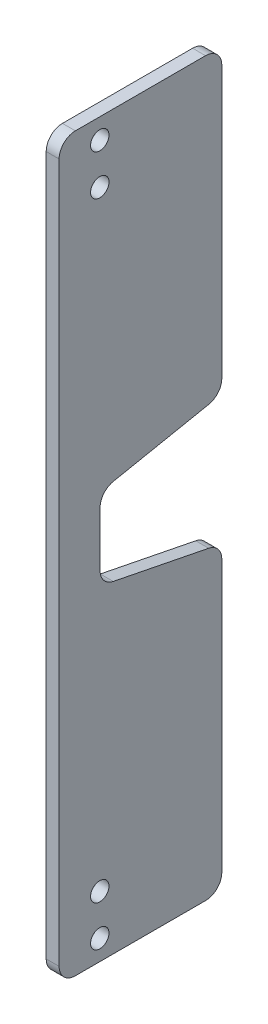
ISO-10303-21;
HEADER;
FILE_DESCRIPTION(('STEP AP214'),'2;1');
FILE_NAME('part.step','',(''),(''),'','','');
FILE_SCHEMA(('AUTOMOTIVE_DESIGN { 1 0 10303 214 1 1 1 1 }'));
ENDSEC;
DATA;
#1=APPLICATION_CONTEXT('core data for automotive mechanical design processes');
#2=APPLICATION_PROTOCOL_DEFINITION('international standard','automotive_design',2000,#1);
#3=PRODUCT_CONTEXT('',#1,'mechanical');
#4=PRODUCT('Part','Part','',(#3));
#5=PRODUCT_RELATED_PRODUCT_CATEGORY('part','',(#4));
#6=PRODUCT_DEFINITION_FORMATION('','',#4);
#7=PRODUCT_DEFINITION_CONTEXT('part definition',#1,'design');
#8=PRODUCT_DEFINITION('design','',#6,#7);
#9=PRODUCT_DEFINITION_SHAPE('','',#8);
#10=(LENGTH_UNIT() NAMED_UNIT(*) SI_UNIT(.MILLI.,.METRE.));
#11=(NAMED_UNIT(*) PLANE_ANGLE_UNIT() SI_UNIT($,.RADIAN.));
#12=(NAMED_UNIT(*) SI_UNIT($,.STERADIAN.) SOLID_ANGLE_UNIT());
#13=UNCERTAINTY_MEASURE_WITH_UNIT(LENGTH_MEASURE(1.E-05),#10,'distance_accuracy_value','');
#14=(GEOMETRIC_REPRESENTATION_CONTEXT(3) GLOBAL_UNCERTAINTY_ASSIGNED_CONTEXT((#13)) GLOBAL_UNIT_ASSIGNED_CONTEXT((#10,
#11,#12)) REPRESENTATION_CONTEXT('',''));
#15=CARTESIAN_POINT('',(0.,0.,0.));
#16=DIRECTION('',(0.,0.,1.));
#17=DIRECTION('',(1.,0.,0.));
#18=AXIS2_PLACEMENT_3D('',#15,#16,#17);
#19=CARTESIAN_POINT('',(0.794249999999999,-50.77,-0.0391447555514955));
#20=DIRECTION('',(0.,-0.980796557409384,-0.195033620111768));
#21=DIRECTION('',(0.,0.195033620111768,-0.980796557409384));
#22=AXIS2_PLACEMENT_3D('',#19,#20,#21);
#23=PLANE('',#22);
#24=DIRECTION('',(0.,-0.195033620111768,0.980796557409384));
#25=VECTOR('',#24,1.);
#26=CARTESIAN_POINT('',(-0.793750000000002,-50.77,-0.039144755551496));
#27=LINE('',#26,#25);
#28=CARTESIAN_POINT('',(-0.793749999999997,-48.1151387809773,-13.3900672402235));
#29=VERTEX_POINT('',#28);
#30=CARTESIAN_POINT('',(-0.793750000000001,-50.4498612190227,-1.64907751532796));
#31=VERTEX_POINT('',#30);
#32=EDGE_CURVE('E202',#29,#31,#27,.T.);
#33=ORIENTED_EDGE('',*,*,#32,.F.);
#34=DIRECTION('',(-1.,0.,0.));
#35=VECTOR('',#34,1.);
#36=CARTESIAN_POINT('',(0.794250000000003,-48.1151387809773,-13.3900672402235));
#37=LINE('',#36,#35);
#38=CARTESIAN_POINT('',(0.794250000000003,-48.1151387809773,-13.3900672402235));
#39=VERTEX_POINT('',#38);
#40=EDGE_CURVE('E289',#29,#39,#37,.F.);
#41=ORIENTED_EDGE('',*,*,#40,.T.);
#42=DIRECTION('',(0.,-0.195033620111768,0.980796557409384));
#43=VECTOR('',#42,1.);
#44=CARTESIAN_POINT('',(0.794249999999999,-50.77,-0.0391447555514955));
#45=LINE('',#44,#43);
#46=CARTESIAN_POINT('',(0.794249999999999,-50.4498612190227,-1.64907751532796));
#47=VERTEX_POINT('',#46);
#48=EDGE_CURVE('E246',#39,#47,#45,.T.);
#49=ORIENTED_EDGE('',*,*,#48,.T.);
#50=DIRECTION('',(-1.,0.,0.));
#51=VECTOR('',#50,1.);
#52=CARTESIAN_POINT('',(-0.793750000000001,-50.4498612190227,-1.64907751532796));
#53=LINE('',#52,#51);
#54=EDGE_CURVE('E250',#47,#31,#53,.T.);
#55=ORIENTED_EDGE('',*,*,#54,.T.);
#56=EDGE_LOOP('',(#33,#41,#49,#55));
#57=FACE_BOUND('',#56,.T.);
#58=ADVANCED_FACE('F38',(#57),#23,.T.);
#59=CARTESIAN_POINT('',(0.794250000000003,-12.795,-15.));
#60=DIRECTION('',(0.,0.,-1.));
#61=DIRECTION('',(-1.,0.,0.));
#62=AXIS2_PLACEMENT_3D('',#59,#60,#61);
#63=PLANE('',#62);
#64=DIRECTION('',(0.,-1.,0.));
#65=VECTOR('',#64,1.);
#66=CARTESIAN_POINT('',(0.794250000000003,-12.795,-15.));
#67=LINE('',#66,#65);
#68=CARTESIAN_POINT('',(0.794250000000003,-12.795,-15.));
#69=VERTEX_POINT('',#68);
#70=CARTESIAN_POINT('',(0.794250000000003,-46.1535456661585,-15.));
#71=VERTEX_POINT('',#70);
#72=EDGE_CURVE('E167',#69,#71,#67,.T.);
#73=ORIENTED_EDGE('',*,*,#72,.T.);
#74=DIRECTION('',(-1.,0.,0.));
#75=VECTOR('',#74,1.);
#76=CARTESIAN_POINT('',(0.794250000000003,-46.1535456661585,-15.));
#77=LINE('',#76,#75);
#78=CARTESIAN_POINT('',(-0.793749999999997,-46.1535456661585,-15.));
#79=VERTEX_POINT('',#78);
#80=EDGE_CURVE('E282',#71,#79,#77,.T.);
#81=ORIENTED_EDGE('',*,*,#80,.T.);
#82=DIRECTION('',(0.,-1.,0.));
#83=VECTOR('',#82,1.);
#84=CARTESIAN_POINT('',(-0.793749999999997,-12.795,-15.));
#85=LINE('',#84,#83);
#86=CARTESIAN_POINT('',(-0.793749999999997,-12.795,-15.));
#87=VERTEX_POINT('',#86);
#88=EDGE_CURVE('E242',#87,#79,#85,.T.);
#89=ORIENTED_EDGE('',*,*,#88,.F.);
#90=DIRECTION('',(-1.,0.,0.));
#91=VECTOR('',#90,1.);
#92=CARTESIAN_POINT('',(0.794250000000003,-12.795,-15.));
#93=LINE('',#92,#91);
#94=EDGE_CURVE('E247',#69,#87,#93,.T.);
#95=ORIENTED_EDGE('',*,*,#94,.F.);
#96=EDGE_LOOP('',(#73,#81,#89,#95));
#97=FACE_BOUND('',#96,.T.);
#98=ADVANCED_FACE('F406',(#97),#63,.T.);
#99=CARTESIAN_POINT('',(0.794250000000003,-12.795,-13.));
#100=DIRECTION('',(-1.,0.,0.));
#101=DIRECTION('',(0.,0.,1.));
#102=AXIS2_PLACEMENT_3D('',#99,#100,#101);
#103=CYLINDRICAL_SURFACE('',#102,2.);
#104=CARTESIAN_POINT('',(-0.793749999999998,-12.795,-13.));
#105=DIRECTION('',(-1.,0.,0.));
#106=DIRECTION('',(0.,0.,1.));
#107=AXIS2_PLACEMENT_3D('',#104,#105,#106);
#108=CIRCLE('',#107,2.);
#109=CARTESIAN_POINT('',(-0.793749999999998,-10.795,-13.));
#110=VERTEX_POINT('',#109);
#111=EDGE_CURVE('E238',#110,#87,#108,.T.);
#112=ORIENTED_EDGE('',*,*,#111,.F.);
#113=DIRECTION('',(-1.,0.,0.));
#114=VECTOR('',#113,1.);
#115=CARTESIAN_POINT('',(0.794250000000003,-10.795,-13.));
#116=LINE('',#115,#114);
#117=CARTESIAN_POINT('',(0.794250000000003,-10.795,-13.));
#118=VERTEX_POINT('',#117);
#119=EDGE_CURVE('E251',#118,#110,#116,.T.);
#120=ORIENTED_EDGE('',*,*,#119,.F.);
#121=CARTESIAN_POINT('',(0.794250000000003,-12.795,-13.));
#122=DIRECTION('',(-1.,0.,0.));
#123=DIRECTION('',(0.,0.,1.));
#124=AXIS2_PLACEMENT_3D('',#121,#122,#123);
#125=CIRCLE('',#124,2.);
#126=EDGE_CURVE('E195',#118,#69,#125,.T.);
#127=ORIENTED_EDGE('',*,*,#126,.T.);
#128=ORIENTED_EDGE('',*,*,#94,.T.);
#129=EDGE_LOOP('',(#112,#120,#127,#128));
#130=FACE_BOUND('',#129,.T.);
#131=ADVANCED_FACE('F413',(#130),#103,.T.);
#132=CARTESIAN_POINT('',(0.794249999999998,-10.795,3.));
#133=DIRECTION('',(0.,1.,0.));
#134=DIRECTION('',(0.,0.,1.));
#135=AXIS2_PLACEMENT_3D('',#132,#133,#134);
#136=PLANE('',#135);
#137=DIRECTION('',(0.,0.,-1.));
#138=VECTOR('',#137,1.);
#139=CARTESIAN_POINT('',(-0.793750000000003,-10.795,3.));
#140=LINE('',#139,#138);
#141=CARTESIAN_POINT('',(-0.793750000000003,-10.795,3.));
#142=VERTEX_POINT('',#141);
#143=EDGE_CURVE('E234',#142,#110,#140,.T.);
#144=ORIENTED_EDGE('',*,*,#143,.F.);
#145=DIRECTION('',(-1.,0.,0.));
#146=VECTOR('',#145,1.);
#147=CARTESIAN_POINT('',(0.794249999999998,-10.795,3.));
#148=LINE('',#147,#146);
#149=CARTESIAN_POINT('',(0.794249999999998,-10.795,3.));
#150=VERTEX_POINT('',#149);
#151=EDGE_CURVE('E254',#150,#142,#148,.T.);
#152=ORIENTED_EDGE('',*,*,#151,.F.);
#153=DIRECTION('',(0.,0.,-1.));
#154=VECTOR('',#153,1.);
#155=CARTESIAN_POINT('',(0.794249999999998,-10.795,3.));
#156=LINE('',#155,#154);
#157=EDGE_CURVE('E191',#150,#118,#156,.T.);
#158=ORIENTED_EDGE('',*,*,#157,.T.);
#159=ORIENTED_EDGE('',*,*,#119,.T.);
#160=EDGE_LOOP('',(#144,#152,#158,#159));
#161=FACE_BOUND('',#160,.T.);
#162=ADVANCED_FACE('F485',(#161),#136,.T.);
#163=CARTESIAN_POINT('',(0.794249999999998,-12.795,3.));
#164=DIRECTION('',(-1.,0.,0.));
#165=DIRECTION('',(0.,0.,1.));
#166=AXIS2_PLACEMENT_3D('',#163,#164,#165);
#167=CYLINDRICAL_SURFACE('',#166,2.);
#168=CARTESIAN_POINT('',(-0.793750000000003,-12.795,3.));
#169=DIRECTION('',(-1.,0.,0.));
#170=DIRECTION('',(0.,0.,1.));
#171=AXIS2_PLACEMENT_3D('',#168,#169,#170);
#172=CIRCLE('',#171,2.);
#173=CARTESIAN_POINT('',(-0.793750000000003,-12.795,5.));
#174=VERTEX_POINT('',#173);
#175=EDGE_CURVE('E230',#174,#142,#172,.T.);
#176=ORIENTED_EDGE('',*,*,#175,.F.);
#177=DIRECTION('',(-1.,0.,0.));
#178=VECTOR('',#177,1.);
#179=CARTESIAN_POINT('',(0.794249999999997,-12.795,5.));
#180=LINE('',#179,#178);
#181=CARTESIAN_POINT('',(0.794249999999997,-12.795,5.));
#182=VERTEX_POINT('',#181);
#183=EDGE_CURVE('E257',#182,#174,#180,.T.);
#184=ORIENTED_EDGE('',*,*,#183,.F.);
#185=CARTESIAN_POINT('',(0.794249999999998,-12.795,3.));
#186=DIRECTION('',(-1.,0.,0.));
#187=DIRECTION('',(0.,0.,1.));
#188=AXIS2_PLACEMENT_3D('',#185,#186,#187);
#189=CIRCLE('',#188,2.);
#190=EDGE_CURVE('E187',#182,#150,#189,.T.);
#191=ORIENTED_EDGE('',*,*,#190,.T.);
#192=ORIENTED_EDGE('',*,*,#151,.T.);
#193=EDGE_LOOP('',(#176,#184,#191,#192));
#194=FACE_BOUND('',#193,.T.);
#195=ADVANCED_FACE('F492',(#194),#167,.T.);
#196=CARTESIAN_POINT('',(0.794249999999997,-38.795,5.));
#197=DIRECTION('',(0.,0.,1.));
#198=DIRECTION('',(1.,0.,0.));
#199=AXIS2_PLACEMENT_3D('',#196,#197,#198);
#200=PLANE('',#199);
#201=DIRECTION('',(0.,1.,0.));
#202=VECTOR('',#201,1.);
#203=CARTESIAN_POINT('',(-0.793750000000003,-38.795,5.));
#204=LINE('',#203,#202);
#205=CARTESIAN_POINT('',(-0.793750000000003,-98.745,5.));
#206=VERTEX_POINT('',#205);
#207=EDGE_CURVE('E226',#206,#174,#204,.T.);
#208=ORIENTED_EDGE('',*,*,#207,.F.);
#209=DIRECTION('',(-1.,0.,0.));
#210=VECTOR('',#209,1.);
#211=CARTESIAN_POINT('',(0.794249999999997,-98.745,5.));
#212=LINE('',#211,#210);
#213=CARTESIAN_POINT('',(0.794249999999997,-98.745,5.));
#214=VERTEX_POINT('',#213);
#215=EDGE_CURVE('E260',#214,#206,#212,.T.);
#216=ORIENTED_EDGE('',*,*,#215,.F.);
#217=DIRECTION('',(0.,1.,0.));
#218=VECTOR('',#217,1.);
#219=CARTESIAN_POINT('',(0.794249999999997,-72.745,5.));
#220=LINE('',#219,#218);
#221=EDGE_CURVE('E184',#214,#182,#220,.T.);
#222=ORIENTED_EDGE('',*,*,#221,.T.);
#223=ORIENTED_EDGE('',*,*,#183,.T.);
#224=EDGE_LOOP('',(#208,#216,#222,#223));
#225=FACE_BOUND('',#224,.T.);
#226=ADVANCED_FACE('F500',(#225),#200,.T.);
#227=CARTESIAN_POINT('',(0.794249999999998,-98.745,3.));
#228=DIRECTION('',(-1.,0.,0.));
#229=DIRECTION('',(0.,0.,1.));
#230=AXIS2_PLACEMENT_3D('',#227,#228,#229);
#231=CYLINDRICAL_SURFACE('',#230,2.);
#232=CARTESIAN_POINT('',(-0.793750000000003,-98.745,3.));
#233=DIRECTION('',(-1.,0.,0.));
#234=DIRECTION('',(0.,0.,-1.));
#235=AXIS2_PLACEMENT_3D('',#232,#233,#234);
#236=CIRCLE('',#235,2.);
#237=CARTESIAN_POINT('',(-0.793750000000003,-100.745,3.));
#238=VERTEX_POINT('',#237);
#239=EDGE_CURVE('E222',#238,#206,#236,.T.);
#240=ORIENTED_EDGE('',*,*,#239,.F.);
#241=DIRECTION('',(-1.,0.,0.));
#242=VECTOR('',#241,1.);
#243=CARTESIAN_POINT('',(0.794249999999998,-100.745,3.));
#244=LINE('',#243,#242);
#245=CARTESIAN_POINT('',(0.794249999999998,-100.745,3.));
#246=VERTEX_POINT('',#245);
#247=EDGE_CURVE('E264',#246,#238,#244,.T.);
#248=ORIENTED_EDGE('',*,*,#247,.F.);
#249=CARTESIAN_POINT('',(0.794249999999998,-98.745,3.));
#250=DIRECTION('',(-1.,0.,0.));
#251=DIRECTION('',(0.,0.,-1.));
#252=AXIS2_PLACEMENT_3D('',#249,#250,#251);
#253=CIRCLE('',#252,2.);
#254=EDGE_CURVE('E177',#246,#214,#253,.T.);
#255=ORIENTED_EDGE('',*,*,#254,.T.);
#256=ORIENTED_EDGE('',*,*,#215,.T.);
#257=EDGE_LOOP('',(#240,#248,#255,#256));
#258=FACE_BOUND('',#257,.T.);
#259=ADVANCED_FACE('F508',(#258),#231,.T.);
#260=CARTESIAN_POINT('',(0.794249999999998,-100.745,3.));
#261=DIRECTION('',(0.,-1.,0.));
#262=DIRECTION('',(0.,0.,-1.));
#263=AXIS2_PLACEMENT_3D('',#260,#261,#262);
#264=PLANE('',#263);
#265=DIRECTION('',(0.,0.,1.));
#266=VECTOR('',#265,1.);
#267=CARTESIAN_POINT('',(-0.793750000000003,-100.745,3.));
#268=LINE('',#267,#266);
#269=CARTESIAN_POINT('',(-0.793749999999998,-100.745,-13.));
#270=VERTEX_POINT('',#269);
#271=EDGE_CURVE('E218',#270,#238,#268,.T.);
#272=ORIENTED_EDGE('',*,*,#271,.F.);
#273=DIRECTION('',(-1.,0.,0.));
#274=VECTOR('',#273,1.);
#275=CARTESIAN_POINT('',(0.794250000000003,-100.745,-13.));
#276=LINE('',#275,#274);
#277=CARTESIAN_POINT('',(0.794250000000003,-100.745,-13.));
#278=VERTEX_POINT('',#277);
#279=EDGE_CURVE('E166',#278,#270,#276,.T.);
#280=ORIENTED_EDGE('',*,*,#279,.F.);
#281=DIRECTION('',(0.,0.,1.));
#282=VECTOR('',#281,1.);
#283=CARTESIAN_POINT('',(0.794249999999998,-100.745,3.));
#284=LINE('',#283,#282);
#285=EDGE_CURVE('E173',#278,#246,#284,.T.);
#286=ORIENTED_EDGE('',*,*,#285,.T.);
#287=ORIENTED_EDGE('',*,*,#247,.T.);
#288=EDGE_LOOP('',(#272,#280,#286,#287));
#289=FACE_BOUND('',#288,.T.);
#290=ADVANCED_FACE('F516',(#289),#264,.T.);
#291=CARTESIAN_POINT('',(0.794250000000003,-98.745,-13.));
#292=DIRECTION('',(-1.,0.,0.));
#293=DIRECTION('',(0.,0.,1.));
#294=AXIS2_PLACEMENT_3D('',#291,#292,#293);
#295=CYLINDRICAL_SURFACE('',#294,2.);
#296=CARTESIAN_POINT('',(-0.793749999999998,-98.745,-13.));
#297=DIRECTION('',(-1.,0.,0.));
#298=DIRECTION('',(0.,0.,-1.));
#299=AXIS2_PLACEMENT_3D('',#296,#297,#298);
#300=CIRCLE('',#299,2.);
#301=CARTESIAN_POINT('',(-0.793749999999997,-98.745,-15.));
#302=VERTEX_POINT('',#301);
#303=EDGE_CURVE('E164',#302,#270,#300,.T.);
#304=ORIENTED_EDGE('',*,*,#303,.F.);
#305=DIRECTION('',(-1.,0.,0.));
#306=VECTOR('',#305,1.);
#307=CARTESIAN_POINT('',(0.794250000000003,-98.745,-15.));
#308=LINE('',#307,#306);
#309=CARTESIAN_POINT('',(0.794250000000003,-98.745,-15.));
#310=VERTEX_POINT('',#309);
#311=EDGE_CURVE('E151',#310,#302,#308,.T.);
#312=ORIENTED_EDGE('',*,*,#311,.F.);
#313=CARTESIAN_POINT('',(0.794250000000003,-98.745,-13.));
#314=DIRECTION('',(-1.,0.,0.));
#315=DIRECTION('',(0.,0.,-1.));
#316=AXIS2_PLACEMENT_3D('',#313,#314,#315);
#317=CIRCLE('',#316,2.);
#318=EDGE_CURVE('E157',#310,#278,#317,.T.);
#319=ORIENTED_EDGE('',*,*,#318,.T.);
#320=ORIENTED_EDGE('',*,*,#279,.T.);
#321=EDGE_LOOP('',(#304,#312,#319,#320));
#322=FACE_BOUND('',#321,.T.);
#323=ADVANCED_FACE('F162',(#322),#295,.T.);
#324=CARTESIAN_POINT('',(0.794250000000003,-98.745,-15.));
#325=DIRECTION('',(0.,0.,-1.));
#326=DIRECTION('',(-1.,0.,0.));
#327=AXIS2_PLACEMENT_3D('',#324,#325,#326);
#328=PLANE('',#327);
#329=DIRECTION('',(0.,-1.,0.));
#330=VECTOR('',#329,1.);
#331=CARTESIAN_POINT('',(-0.793749999999997,-98.745,-15.));
#332=LINE('',#331,#330);
#333=CARTESIAN_POINT('',(-0.793749999999997,-65.3864543338415,-15.));
#334=VERTEX_POINT('',#333);
#335=EDGE_CURVE('E213',#334,#302,#332,.T.);
#336=ORIENTED_EDGE('',*,*,#335,.F.);
#337=DIRECTION('',(-1.,0.,0.));
#338=VECTOR('',#337,1.);
#339=CARTESIAN_POINT('',(0.794250000000003,-65.3864543338415,-15.));
#340=LINE('',#339,#338);
#341=CARTESIAN_POINT('',(0.794250000000003,-65.3864543338415,-15.));
#342=VERTEX_POINT('',#341);
#343=EDGE_CURVE('E47',#334,#342,#340,.F.);
#344=ORIENTED_EDGE('',*,*,#343,.T.);
#345=DIRECTION('',(0.,-1.,0.));
#346=VECTOR('',#345,1.);
#347=CARTESIAN_POINT('',(0.794250000000003,-98.745,-15.));
#348=LINE('',#347,#346);
#349=EDGE_CURVE('E148',#342,#310,#348,.T.);
#350=ORIENTED_EDGE('',*,*,#349,.T.);
#351=ORIENTED_EDGE('',*,*,#311,.T.);
#352=EDGE_LOOP('',(#336,#344,#350,#351));
#353=FACE_BOUND('',#352,.T.);
#354=ADVANCED_FACE('F150',(#353),#328,.T.);
#355=CARTESIAN_POINT('',(0.794249999999999,-60.77,-0.0391447555514949));
#356=DIRECTION('',(0.,0.980796557409384,-0.195033620111768));
#357=DIRECTION('',(0.,0.195033620111768,0.980796557409384));
#358=AXIS2_PLACEMENT_3D('',#355,#356,#357);
#359=PLANE('',#358);
#360=DIRECTION('',(0.,-0.195033620111768,-0.980796557409384));
#361=VECTOR('',#360,1.);
#362=CARTESIAN_POINT('',(0.794249999999999,-60.77,-0.0391447555514949));
#363=LINE('',#362,#361);
#364=CARTESIAN_POINT('',(0.794249999999999,-61.0901387809773,-1.64907751532796));
#365=VERTEX_POINT('',#364);
#366=CARTESIAN_POINT('',(0.794250000000003,-63.4248612190227,-13.3900672402235));
#367=VERTEX_POINT('',#366);
#368=EDGE_CURVE('E158',#365,#367,#363,.T.);
#369=ORIENTED_EDGE('',*,*,#368,.T.);
#370=DIRECTION('',(-1.,0.,0.));
#371=VECTOR('',#370,1.);
#372=CARTESIAN_POINT('',(0.794250000000003,-63.4248612190227,-13.3900672402235));
#373=LINE('',#372,#371);
#374=CARTESIAN_POINT('',(-0.793749999999997,-63.4248612190227,-13.3900672402235));
#375=VERTEX_POINT('',#374);
#376=EDGE_CURVE('E308',#367,#375,#373,.T.);
#377=ORIENTED_EDGE('',*,*,#376,.T.);
#378=DIRECTION('',(0.,-0.195033620111768,-0.980796557409384));
#379=VECTOR('',#378,1.);
#380=CARTESIAN_POINT('',(-0.793750000000002,-60.77,-0.0391447555514954));
#381=LINE('',#380,#379);
#382=CARTESIAN_POINT('',(-0.793750000000001,-61.0901387809773,-1.64907751532796));
#383=VERTEX_POINT('',#382);
#384=EDGE_CURVE('E210',#383,#375,#381,.T.);
#385=ORIENTED_EDGE('',*,*,#384,.F.);
#386=DIRECTION('',(-1.,0.,0.));
#387=VECTOR('',#386,1.);
#388=CARTESIAN_POINT('',(0.794249999999999,-61.0901387809773,-1.64907751532796));
#389=LINE('',#388,#387);
#390=EDGE_CURVE('E299',#383,#365,#389,.F.);
#391=ORIENTED_EDGE('',*,*,#390,.T.);
#392=EDGE_LOOP('',(#369,#377,#385,#391));
#393=FACE_BOUND('',#392,.T.);
#394=ADVANCED_FACE('F318',(#393),#359,.T.);
#395=CARTESIAN_POINT('',(0.794249999999999,-55.77,-0.0391447555514949));
#396=DIRECTION('',(0.,0.,-1.));
#397=DIRECTION('',(-1.,0.,0.));
#398=AXIS2_PLACEMENT_3D('',#395,#396,#397);
#399=PLANE('',#398);
#400=DIRECTION('',(0.,-1.,0.));
#401=VECTOR('',#400,1.);
#402=CARTESIAN_POINT('',(0.794249999999999,-55.77,-0.0391447555514949));
#403=LINE('',#402,#401);
#404=CARTESIAN_POINT('',(0.794249999999999,-52.4114543338415,-0.0391447555514953));
#405=VERTEX_POINT('',#404);
#406=CARTESIAN_POINT('',(0.794249999999999,-59.1285456661585,-0.0391447555514945));
#407=VERTEX_POINT('',#406);
#408=EDGE_CURVE('E333',#405,#407,#403,.T.);
#409=ORIENTED_EDGE('',*,*,#408,.T.);
#410=DIRECTION('',(-1.,0.,0.));
#411=VECTOR('',#410,1.);
#412=CARTESIAN_POINT('',(-0.793750000000002,-59.1285456661585,-0.0391447555514954));
#413=LINE('',#412,#411);
#414=CARTESIAN_POINT('',(-0.793750000000002,-59.1285456661585,-0.0391447555514954));
#415=VERTEX_POINT('',#414);
#416=EDGE_CURVE('E295',#407,#415,#413,.T.);
#417=ORIENTED_EDGE('',*,*,#416,.T.);
#418=DIRECTION('',(0.,-1.,0.));
#419=VECTOR('',#418,1.);
#420=CARTESIAN_POINT('',(-0.793750000000002,-55.77,-0.0391447555514954));
#421=LINE('',#420,#419);
#422=CARTESIAN_POINT('',(-0.793750000000002,-52.4114543338415,-0.0391447555514954));
#423=VERTEX_POINT('',#422);
#424=EDGE_CURVE('E205',#423,#415,#421,.T.);
#425=ORIENTED_EDGE('',*,*,#424,.F.);
#426=DIRECTION('',(-1.,0.,0.));
#427=VECTOR('',#426,1.);
#428=CARTESIAN_POINT('',(0.794249999999999,-52.4114543338415,-0.0391447555514949));
#429=LINE('',#428,#427);
#430=EDGE_CURVE('E272',#423,#405,#429,.F.);
#431=ORIENTED_EDGE('',*,*,#430,.T.);
#432=EDGE_LOOP('',(#409,#417,#425,#431));
#433=FACE_BOUND('',#432,.T.);
#434=ADVANCED_FACE('F330',(#433),#399,.T.);
#435=CARTESIAN_POINT('',(0.794250000000003,-12.795,-13.));
#436=DIRECTION('',(-1.,0.,0.));
#437=DIRECTION('',(0.,0.,1.));
#438=AXIS2_PLACEMENT_3D('',#435,#436,#437);
#439=PLANE('',#438);
#440=CARTESIAN_POINT('',(0.794249999999999,-93.245,0.));
#441=DIRECTION('',(-1.,0.,0.));
#442=DIRECTION('',(0.,0.,1.));
#443=AXIS2_PLACEMENT_3D('',#440,#441,#442);
#444=CIRCLE('',#443,1.1303);
#445=CARTESIAN_POINT('',(0.794249999999998,-93.245,1.1303));
#446=VERTEX_POINT('',#445);
#447=EDGE_CURVE('E361',#446,#446,#444,.T.);
#448=ORIENTED_EDGE('',*,*,#447,.T.);
#449=EDGE_LOOP('',(#448));
#450=FACE_BOUND('',#449,.T.);
#451=CARTESIAN_POINT('',(0.794249999999999,-98.245,0.));
#452=DIRECTION('',(-1.,0.,0.));
#453=DIRECTION('',(0.,0.,1.));
#454=AXIS2_PLACEMENT_3D('',#451,#452,#453);
#455=CIRCLE('',#454,1.1303);
#456=CARTESIAN_POINT('',(0.794249999999998,-98.245,1.1303));
#457=VERTEX_POINT('',#456);
#458=EDGE_CURVE('E353',#457,#457,#455,.T.);
#459=ORIENTED_EDGE('',*,*,#458,.T.);
#460=EDGE_LOOP('',(#459));
#461=FACE_BOUND('',#460,.T.);
#462=CARTESIAN_POINT('',(0.794249999999999,-13.295,0.));
#463=DIRECTION('',(-1.,0.,0.));
#464=DIRECTION('',(0.,0.,-1.));
#465=AXIS2_PLACEMENT_3D('',#462,#463,#464);
#466=CIRCLE('',#465,1.1303);
#467=CARTESIAN_POINT('',(0.794249999999999,-13.295,-1.1303));
#468=VERTEX_POINT('',#467);
#469=EDGE_CURVE('E345',#468,#468,#466,.T.);
#470=ORIENTED_EDGE('',*,*,#469,.T.);
#471=EDGE_LOOP('',(#470));
#472=FACE_BOUND('',#471,.T.);
#473=CARTESIAN_POINT('',(0.794249999999999,-18.295,0.));
#474=DIRECTION('',(-1.,0.,0.));
#475=DIRECTION('',(0.,0.,-1.));
#476=AXIS2_PLACEMENT_3D('',#473,#474,#475);
#477=CIRCLE('',#476,1.1303);
#478=CARTESIAN_POINT('',(0.794249999999999,-18.295,-1.1303));
#479=VERTEX_POINT('',#478);
#480=EDGE_CURVE('E206',#479,#479,#477,.T.);
#481=ORIENTED_EDGE('',*,*,#480,.T.);
#482=EDGE_LOOP('',(#481));
#483=FACE_BOUND('',#482,.T.);
#484=ORIENTED_EDGE('',*,*,#349,.F.);
#485=CARTESIAN_POINT('',(0.794250000000003,-65.3864543338415,-13.));
#486=DIRECTION('',(-1.,0.,0.));
#487=DIRECTION('',(0.,0.,1.));
#488=AXIS2_PLACEMENT_3D('',#485,#486,#487);
#489=CIRCLE('',#488,2.);
#490=EDGE_CURVE('E11',#342,#367,#489,.F.);
#491=ORIENTED_EDGE('',*,*,#490,.T.);
#492=ORIENTED_EDGE('',*,*,#368,.F.);
#493=CARTESIAN_POINT('',(0.794249999999999,-59.1285456661585,-2.03914475555149));
#494=DIRECTION('',(-1.,0.,0.));
#495=DIRECTION('',(0.,0.,1.));
#496=AXIS2_PLACEMENT_3D('',#493,#494,#495);
#497=CIRCLE('',#496,2.);
#498=EDGE_CURVE('E305',#365,#407,#497,.T.);
#499=ORIENTED_EDGE('',*,*,#498,.T.);
#500=ORIENTED_EDGE('',*,*,#408,.F.);
#501=CARTESIAN_POINT('',(0.794249999999999,-52.4114543338415,-2.03914475555149));
#502=DIRECTION('',(-1.,0.,0.));
#503=DIRECTION('',(0.,0.,1.));
#504=AXIS2_PLACEMENT_3D('',#501,#502,#503);
#505=CIRCLE('',#504,2.);
#506=EDGE_CURVE('E278',#405,#47,#505,.T.);
#507=ORIENTED_EDGE('',*,*,#506,.T.);
#508=ORIENTED_EDGE('',*,*,#48,.F.);
#509=CARTESIAN_POINT('',(0.794250000000003,-46.1535456661585,-13.));
#510=DIRECTION('',(-1.,0.,0.));
#511=DIRECTION('',(0.,0.,1.));
#512=AXIS2_PLACEMENT_3D('',#509,#510,#511);
#513=CIRCLE('',#512,2.);
#514=EDGE_CURVE('E292',#39,#71,#513,.F.);
#515=ORIENTED_EDGE('',*,*,#514,.T.);
#516=ORIENTED_EDGE('',*,*,#72,.F.);
#517=ORIENTED_EDGE('',*,*,#126,.F.);
#518=ORIENTED_EDGE('',*,*,#157,.F.);
#519=ORIENTED_EDGE('',*,*,#190,.F.);
#520=ORIENTED_EDGE('',*,*,#221,.F.);
#521=ORIENTED_EDGE('',*,*,#254,.F.);
#522=ORIENTED_EDGE('',*,*,#285,.F.);
#523=ORIENTED_EDGE('',*,*,#318,.F.);
#524=EDGE_LOOP('',(#484,#491,#492,#499,#500,#507,#508,#515,#516,#517,#518,#519,#520,#521,#522,#523));
#525=FACE_BOUND('',#524,.T.);
#526=ADVANCED_FACE('F170',(#450,#461,#472,#483,#525),#439,.F.);
#527=CARTESIAN_POINT('',(-0.793749999999998,-12.795,-13.));
#528=DIRECTION('',(-1.,0.,0.));
#529=DIRECTION('',(0.,0.,1.));
#530=AXIS2_PLACEMENT_3D('',#527,#528,#529);
#531=PLANE('',#530);
#532=CARTESIAN_POINT('',(-0.793750000000002,-93.245,0.));
#533=DIRECTION('',(-1.,0.,0.));
#534=DIRECTION('',(0.,0.,1.));
#535=AXIS2_PLACEMENT_3D('',#532,#533,#534);
#536=CIRCLE('',#535,1.1303);
#537=CARTESIAN_POINT('',(-0.793750000000002,-93.245,1.1303));
#538=VERTEX_POINT('',#537);
#539=EDGE_CURVE('E365',#538,#538,#536,.T.);
#540=ORIENTED_EDGE('',*,*,#539,.F.);
#541=EDGE_LOOP('',(#540));
#542=FACE_BOUND('',#541,.T.);
#543=CARTESIAN_POINT('',(-0.793750000000002,-98.245,0.));
#544=DIRECTION('',(-1.,0.,0.));
#545=DIRECTION('',(0.,0.,1.));
#546=AXIS2_PLACEMENT_3D('',#543,#544,#545);
#547=CIRCLE('',#546,1.1303);
#548=CARTESIAN_POINT('',(-0.793750000000002,-98.245,1.1303));
#549=VERTEX_POINT('',#548);
#550=EDGE_CURVE('E357',#549,#549,#547,.T.);
#551=ORIENTED_EDGE('',*,*,#550,.F.);
#552=EDGE_LOOP('',(#551));
#553=FACE_BOUND('',#552,.T.);
#554=CARTESIAN_POINT('',(-0.793750000000002,-13.295,0.));
#555=DIRECTION('',(-1.,0.,0.));
#556=DIRECTION('',(0.,0.,-1.));
#557=AXIS2_PLACEMENT_3D('',#554,#555,#556);
#558=CIRCLE('',#557,1.1303);
#559=CARTESIAN_POINT('',(-0.793750000000001,-13.295,-1.1303));
#560=VERTEX_POINT('',#559);
#561=EDGE_CURVE('E349',#560,#560,#558,.T.);
#562=ORIENTED_EDGE('',*,*,#561,.F.);
#563=EDGE_LOOP('',(#562));
#564=FACE_BOUND('',#563,.T.);
#565=CARTESIAN_POINT('',(-0.793750000000002,-18.295,0.));
#566=DIRECTION('',(-1.,0.,0.));
#567=DIRECTION('',(0.,0.,-1.));
#568=AXIS2_PLACEMENT_3D('',#565,#566,#567);
#569=CIRCLE('',#568,1.1303);
#570=CARTESIAN_POINT('',(-0.793750000000001,-18.295,-1.1303));
#571=VERTEX_POINT('',#570);
#572=EDGE_CURVE('E341',#571,#571,#569,.T.);
#573=ORIENTED_EDGE('',*,*,#572,.F.);
#574=EDGE_LOOP('',(#573));
#575=FACE_BOUND('',#574,.T.);
#576=ORIENTED_EDGE('',*,*,#384,.T.);
#577=CARTESIAN_POINT('',(-0.793749999999998,-65.3864543338415,-13.));
#578=DIRECTION('',(-1.,0.,0.));
#579=DIRECTION('',(0.,0.,1.));
#580=AXIS2_PLACEMENT_3D('',#577,#578,#579);
#581=CIRCLE('',#580,2.);
#582=EDGE_CURVE('E61',#375,#334,#581,.T.);
#583=ORIENTED_EDGE('',*,*,#582,.T.);
#584=ORIENTED_EDGE('',*,*,#335,.T.);
#585=ORIENTED_EDGE('',*,*,#303,.T.);
#586=ORIENTED_EDGE('',*,*,#271,.T.);
#587=ORIENTED_EDGE('',*,*,#239,.T.);
#588=ORIENTED_EDGE('',*,*,#207,.T.);
#589=ORIENTED_EDGE('',*,*,#175,.T.);
#590=ORIENTED_EDGE('',*,*,#143,.T.);
#591=ORIENTED_EDGE('',*,*,#111,.T.);
#592=ORIENTED_EDGE('',*,*,#88,.T.);
#593=CARTESIAN_POINT('',(-0.793749999999998,-46.1535456661585,-13.));
#594=DIRECTION('',(-1.,0.,0.));
#595=DIRECTION('',(0.,0.,1.));
#596=AXIS2_PLACEMENT_3D('',#593,#594,#595);
#597=CIRCLE('',#596,2.);
#598=EDGE_CURVE('E286',#79,#29,#597,.T.);
#599=ORIENTED_EDGE('',*,*,#598,.T.);
#600=ORIENTED_EDGE('',*,*,#32,.T.);
#601=CARTESIAN_POINT('',(-0.793750000000001,-52.4114543338415,-2.03914475555149));
#602=DIRECTION('',(-1.,0.,0.));
#603=DIRECTION('',(0.,0.,1.));
#604=AXIS2_PLACEMENT_3D('',#601,#602,#603);
#605=CIRCLE('',#604,2.);
#606=EDGE_CURVE('E275',#31,#423,#605,.F.);
#607=ORIENTED_EDGE('',*,*,#606,.T.);
#608=ORIENTED_EDGE('',*,*,#424,.T.);
#609=CARTESIAN_POINT('',(-0.793750000000001,-59.1285456661585,-2.03914475555149));
#610=DIRECTION('',(-1.,0.,0.));
#611=DIRECTION('',(0.,0.,1.));
#612=AXIS2_PLACEMENT_3D('',#609,#610,#611);
#613=CIRCLE('',#612,2.);
#614=EDGE_CURVE('E302',#415,#383,#613,.F.);
#615=ORIENTED_EDGE('',*,*,#614,.T.);
#616=EDGE_LOOP('',(#576,#583,#584,#585,#586,#587,#588,#589,#590,#591,#592,#599,#600,#607,#608,#615));
#617=FACE_BOUND('',#616,.T.);
#618=ADVANCED_FACE('F322',(#542,#553,#564,#575,#617),#531,.T.);
#619=CARTESIAN_POINT('',(0.794249999999999,-18.295,0.));
#620=DIRECTION('',(-1.,0.,0.));
#621=DIRECTION('',(0.,0.,1.));
#622=AXIS2_PLACEMENT_3D('',#619,#620,#621);
#623=CYLINDRICAL_SURFACE('',#622,1.1303);
#624=ORIENTED_EDGE('',*,*,#480,.F.);
#625=EDGE_LOOP('',(#624));
#626=FACE_BOUND('',#625,.T.);
#627=ORIENTED_EDGE('',*,*,#572,.T.);
#628=EDGE_LOOP('',(#627));
#629=FACE_BOUND('',#628,.T.);
#630=ADVANCED_FACE('F385',(#626,#629),#623,.F.);
#631=CARTESIAN_POINT('',(0.794249999999999,-13.295,0.));
#632=DIRECTION('',(-1.,0.,0.));
#633=DIRECTION('',(0.,0.,1.));
#634=AXIS2_PLACEMENT_3D('',#631,#632,#633);
#635=CYLINDRICAL_SURFACE('',#634,1.1303);
#636=ORIENTED_EDGE('',*,*,#469,.F.);
#637=EDGE_LOOP('',(#636));
#638=FACE_BOUND('',#637,.T.);
#639=ORIENTED_EDGE('',*,*,#561,.T.);
#640=EDGE_LOOP('',(#639));
#641=FACE_BOUND('',#640,.T.);
#642=ADVANCED_FACE('F394',(#638,#641),#635,.F.);
#643=CARTESIAN_POINT('',(0.794249999999999,-98.245,0.));
#644=DIRECTION('',(-1.,0.,0.));
#645=DIRECTION('',(0.,0.,1.));
#646=AXIS2_PLACEMENT_3D('',#643,#644,#645);
#647=CYLINDRICAL_SURFACE('',#646,1.1303);
#648=ORIENTED_EDGE('',*,*,#458,.F.);
#649=EDGE_LOOP('',(#648));
#650=FACE_BOUND('',#649,.T.);
#651=ORIENTED_EDGE('',*,*,#550,.T.);
#652=EDGE_LOOP('',(#651));
#653=FACE_BOUND('',#652,.T.);
#654=ADVANCED_FACE('F379',(#650,#653),#647,.F.);
#655=CARTESIAN_POINT('',(0.794249999999999,-93.245,0.));
#656=DIRECTION('',(-1.,0.,0.));
#657=DIRECTION('',(0.,0.,1.));
#658=AXIS2_PLACEMENT_3D('',#655,#656,#657);
#659=CYLINDRICAL_SURFACE('',#658,1.1303);
#660=ORIENTED_EDGE('',*,*,#447,.F.);
#661=EDGE_LOOP('',(#660));
#662=FACE_BOUND('',#661,.T.);
#663=ORIENTED_EDGE('',*,*,#539,.T.);
#664=EDGE_LOOP('',(#663));
#665=FACE_BOUND('',#664,.T.);
#666=ADVANCED_FACE('F375',(#662,#665),#659,.F.);
#667=CARTESIAN_POINT('',(0.794249999999999,-52.4114543338415,-2.03914475555149));
#668=DIRECTION('',(1.,0.,0.));
#669=DIRECTION('',(0.,0.,-1.));
#670=AXIS2_PLACEMENT_3D('',#667,#668,#669);
#671=CYLINDRICAL_SURFACE('',#670,2.);
#672=ORIENTED_EDGE('',*,*,#506,.F.);
#673=ORIENTED_EDGE('',*,*,#430,.F.);
#674=ORIENTED_EDGE('',*,*,#606,.F.);
#675=ORIENTED_EDGE('',*,*,#54,.F.);
#676=EDGE_LOOP('',(#672,#673,#674,#675));
#677=FACE_BOUND('',#676,.T.);
#678=ADVANCED_FACE('F378',(#677),#671,.F.);
#679=CARTESIAN_POINT('',(0.794250000000003,-46.1535456661585,-13.));
#680=DIRECTION('',(-1.,0.,0.));
#681=DIRECTION('',(0.,0.,1.));
#682=AXIS2_PLACEMENT_3D('',#679,#680,#681);
#683=CYLINDRICAL_SURFACE('',#682,2.);
#684=ORIENTED_EDGE('',*,*,#514,.F.);
#685=ORIENTED_EDGE('',*,*,#40,.F.);
#686=ORIENTED_EDGE('',*,*,#598,.F.);
#687=ORIENTED_EDGE('',*,*,#80,.F.);
#688=EDGE_LOOP('',(#684,#685,#686,#687));
#689=FACE_BOUND('',#688,.T.);
#690=ADVANCED_FACE('F422',(#689),#683,.T.);
#691=CARTESIAN_POINT('',(0.794249999999999,-59.1285456661585,-2.03914475555149));
#692=DIRECTION('',(1.,0.,0.));
#693=DIRECTION('',(0.,0.,-1.));
#694=AXIS2_PLACEMENT_3D('',#691,#692,#693);
#695=CYLINDRICAL_SURFACE('',#694,2.);
#696=ORIENTED_EDGE('',*,*,#498,.F.);
#697=ORIENTED_EDGE('',*,*,#390,.F.);
#698=ORIENTED_EDGE('',*,*,#614,.F.);
#699=ORIENTED_EDGE('',*,*,#416,.F.);
#700=EDGE_LOOP('',(#696,#697,#698,#699));
#701=FACE_BOUND('',#700,.T.);
#702=ADVANCED_FACE('F327',(#701),#695,.F.);
#703=CARTESIAN_POINT('',(0.794250000000003,-65.3864543338415,-13.));
#704=DIRECTION('',(-1.,0.,0.));
#705=DIRECTION('',(0.,0.,1.));
#706=AXIS2_PLACEMENT_3D('',#703,#704,#705);
#707=CYLINDRICAL_SURFACE('',#706,2.);
#708=ORIENTED_EDGE('',*,*,#490,.F.);
#709=ORIENTED_EDGE('',*,*,#343,.F.);
#710=ORIENTED_EDGE('',*,*,#582,.F.);
#711=ORIENTED_EDGE('',*,*,#376,.F.);
#712=EDGE_LOOP('',(#708,#709,#710,#711));
#713=FACE_BOUND('',#712,.T.);
#714=ADVANCED_FACE('F40',(#713),#707,.T.);
#715=CLOSED_SHELL('',(#58,#98,#131,#162,#195,#226,#259,#290,#323,#354,#394,#434,#526,#618,#630,
#642,#654,#666,#678,#690,#702,#714));
#716=MANIFOLD_SOLID_BREP('B2',#715);
#717=ADVANCED_BREP_SHAPE_REPRESENTATION('',(#18,#716),#14);
#718=SHAPE_DEFINITION_REPRESENTATION(#9,#717);
ENDSEC;
END-ISO-10303-21;
